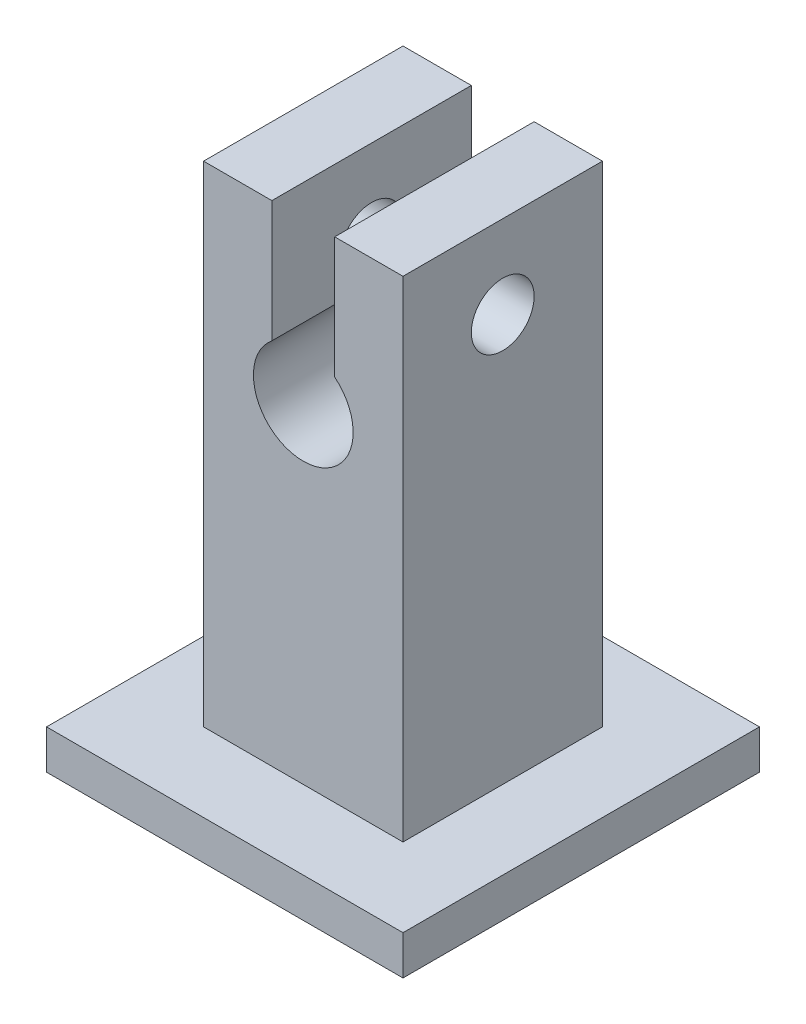
ISO-10303-21;
HEADER;
FILE_DESCRIPTION(('STEP AP214'),'2;1');
FILE_NAME('part.step','',(''),(''),'','','');
FILE_SCHEMA(('AUTOMOTIVE_DESIGN { 1 0 10303 214 1 1 1 1 }'));
ENDSEC;
DATA;
#1=APPLICATION_CONTEXT('core data for automotive mechanical design processes');
#2=APPLICATION_PROTOCOL_DEFINITION('international standard','automotive_design',2000,#1);
#3=PRODUCT_CONTEXT('',#1,'mechanical');
#4=PRODUCT('Part','Part','',(#3));
#5=PRODUCT_RELATED_PRODUCT_CATEGORY('part','',(#4));
#6=PRODUCT_DEFINITION_FORMATION('','',#4);
#7=PRODUCT_DEFINITION_CONTEXT('part definition',#1,'design');
#8=PRODUCT_DEFINITION('design','',#6,#7);
#9=PRODUCT_DEFINITION_SHAPE('','',#8);
#10=(LENGTH_UNIT() NAMED_UNIT(*) SI_UNIT(.MILLI.,.METRE.));
#11=(NAMED_UNIT(*) PLANE_ANGLE_UNIT() SI_UNIT($,.RADIAN.));
#12=(NAMED_UNIT(*) SI_UNIT($,.STERADIAN.) SOLID_ANGLE_UNIT());
#13=UNCERTAINTY_MEASURE_WITH_UNIT(LENGTH_MEASURE(1.E-05),#10,'distance_accuracy_value','');
#14=(GEOMETRIC_REPRESENTATION_CONTEXT(3) GLOBAL_UNCERTAINTY_ASSIGNED_CONTEXT((#13)) GLOBAL_UNIT_ASSIGNED_CONTEXT((#10,
#11,#12)) REPRESENTATION_CONTEXT('',''));
#15=CARTESIAN_POINT('',(0.,0.,0.));
#16=DIRECTION('',(0.,0.,1.));
#17=DIRECTION('',(1.,0.,0.));
#18=AXIS2_PLACEMENT_3D('',#15,#16,#17);
#19=CARTESIAN_POINT('',(0.,0.,12.7));
#20=DIRECTION('',(-1.,0.,0.));
#21=DIRECTION('',(0.,0.,1.));
#22=AXIS2_PLACEMENT_3D('',#19,#20,#21);
#23=PLANE('',#22);
#24=CARTESIAN_POINT('',(0.,25.920446166708,6.35));
#25=DIRECTION('',(1.,0.,0.));
#26=DIRECTION('',(0.,0.,-1.));
#27=AXIS2_PLACEMENT_3D('',#24,#25,#26);
#28=CIRCLE('',#27,2.);
#29=CARTESIAN_POINT('',(0.,25.920446166708,4.35));
#30=VERTEX_POINT('',#29);
#31=EDGE_CURVE('E218',#30,#30,#28,.T.);
#32=ORIENTED_EDGE('',*,*,#31,.F.);
#33=EDGE_LOOP('',(#32));
#34=FACE_BOUND('',#33,.T.);
#35=DIRECTION('',(0.,1.,0.));
#36=VECTOR('',#35,1.);
#37=CARTESIAN_POINT('',(0.,0.,0.));
#38=LINE('',#37,#36);
#39=CARTESIAN_POINT('',(0.,0.,0.));
#40=VERTEX_POINT('',#39);
#41=CARTESIAN_POINT('',(0.,31.2,0.));
#42=VERTEX_POINT('',#41);
#43=EDGE_CURVE('E130',#40,#42,#38,.T.);
#44=ORIENTED_EDGE('',*,*,#43,.T.);
#45=DIRECTION('',(0.,0.,-1.));
#46=VECTOR('',#45,1.);
#47=CARTESIAN_POINT('',(0.,31.2,12.7));
#48=LINE('',#47,#46);
#49=CARTESIAN_POINT('',(0.,31.2,12.7));
#50=VERTEX_POINT('',#49);
#51=EDGE_CURVE('E39',#50,#42,#48,.T.);
#52=ORIENTED_EDGE('',*,*,#51,.F.);
#53=DIRECTION('',(0.,1.,0.));
#54=VECTOR('',#53,1.);
#55=CARTESIAN_POINT('',(0.,0.,12.7));
#56=LINE('',#55,#54);
#57=CARTESIAN_POINT('',(0.,0.,12.7));
#58=VERTEX_POINT('',#57);
#59=EDGE_CURVE('E88',#58,#50,#56,.T.);
#60=ORIENTED_EDGE('',*,*,#59,.F.);
#61=DIRECTION('',(0.,0.,-1.));
#62=VECTOR('',#61,1.);
#63=CARTESIAN_POINT('',(0.,0.,12.7));
#64=LINE('',#63,#62);
#65=EDGE_CURVE('E11',#58,#40,#64,.T.);
#66=ORIENTED_EDGE('',*,*,#65,.T.);
#67=EDGE_LOOP('',(#44,#52,#60,#66));
#68=FACE_BOUND('',#67,.T.);
#69=ADVANCED_FACE('F30',(#34,#68),#23,.F.);
#70=CARTESIAN_POINT('',(0.,31.2,12.7));
#71=DIRECTION('',(0.,-1.,0.));
#72=DIRECTION('',(1.,0.,0.));
#73=AXIS2_PLACEMENT_3D('',#70,#71,#72);
#74=PLANE('',#73);
#75=DIRECTION('',(-1.,0.,0.));
#76=VECTOR('',#75,1.);
#77=CARTESIAN_POINT('',(0.,31.2,0.));
#78=LINE('',#77,#76);
#79=CARTESIAN_POINT('',(-4.35,31.2,0.));
#80=VERTEX_POINT('',#79);
#81=EDGE_CURVE('E133',#42,#80,#78,.T.);
#82=ORIENTED_EDGE('',*,*,#81,.T.);
#83=DIRECTION('',(0.,0.,-1.));
#84=VECTOR('',#83,1.);
#85=CARTESIAN_POINT('',(-4.35,31.2,12.7));
#86=LINE('',#85,#84);
#87=CARTESIAN_POINT('',(-4.35,31.2,12.7));
#88=VERTEX_POINT('',#87);
#89=EDGE_CURVE('E150',#88,#80,#86,.T.);
#90=ORIENTED_EDGE('',*,*,#89,.F.);
#91=DIRECTION('',(-1.,0.,0.));
#92=VECTOR('',#91,1.);
#93=CARTESIAN_POINT('',(0.,31.2,12.7));
#94=LINE('',#93,#92);
#95=EDGE_CURVE('E159',#50,#88,#94,.T.);
#96=ORIENTED_EDGE('',*,*,#95,.F.);
#97=ORIENTED_EDGE('',*,*,#51,.T.);
#98=EDGE_LOOP('',(#82,#90,#96,#97));
#99=FACE_BOUND('',#98,.T.);
#100=ADVANCED_FACE('F157',(#99),#74,.F.);
#101=CARTESIAN_POINT('',(-4.35,31.2,12.7));
#102=DIRECTION('',(1.,0.,0.));
#103=DIRECTION('',(0.,0.,-1.));
#104=AXIS2_PLACEMENT_3D('',#101,#102,#103);
#105=PLANE('',#104);
#106=CARTESIAN_POINT('',(-4.35,25.920446166708,6.35));
#107=DIRECTION('',(1.,0.,0.));
#108=DIRECTION('',(0.,0.,-1.));
#109=AXIS2_PLACEMENT_3D('',#106,#107,#108);
#110=CIRCLE('',#109,2.);
#111=CARTESIAN_POINT('',(-4.35,25.920446166708,4.35));
#112=VERTEX_POINT('',#111);
#113=EDGE_CURVE('E202',#112,#112,#110,.T.);
#114=ORIENTED_EDGE('',*,*,#113,.T.);
#115=EDGE_LOOP('',(#114));
#116=FACE_BOUND('',#115,.T.);
#117=DIRECTION('',(0.,-1.,0.));
#118=VECTOR('',#117,1.);
#119=CARTESIAN_POINT('',(-4.35,31.2,0.));
#120=LINE('',#119,#118);
#121=CARTESIAN_POINT('',(-4.35,23.465892333416,0.));
#122=VERTEX_POINT('',#121);
#123=EDGE_CURVE('E135',#80,#122,#120,.T.);
#124=ORIENTED_EDGE('',*,*,#123,.T.);
#125=DIRECTION('',(0.,0.,-1.));
#126=VECTOR('',#125,1.);
#127=CARTESIAN_POINT('',(-4.35,23.465892333416,12.7));
#128=LINE('',#127,#126);
#129=CARTESIAN_POINT('',(-4.35,23.465892333416,12.7));
#130=VERTEX_POINT('',#129);
#131=EDGE_CURVE('E147',#130,#122,#128,.T.);
#132=ORIENTED_EDGE('',*,*,#131,.F.);
#133=DIRECTION('',(0.,-1.,0.));
#134=VECTOR('',#133,1.);
#135=CARTESIAN_POINT('',(-4.35,31.2,12.7));
#136=LINE('',#135,#134);
#137=EDGE_CURVE('E171',#88,#130,#136,.T.);
#138=ORIENTED_EDGE('',*,*,#137,.F.);
#139=ORIENTED_EDGE('',*,*,#89,.T.);
#140=EDGE_LOOP('',(#124,#132,#138,#139));
#141=FACE_BOUND('',#140,.T.);
#142=ADVANCED_FACE('F167',(#116,#141),#105,.F.);
#143=CARTESIAN_POINT('',(-6.35,21.,12.7));
#144=DIRECTION('',(0.,0.,-1.));
#145=DIRECTION('',(-1.,0.,0.));
#146=AXIS2_PLACEMENT_3D('',#143,#144,#145);
#147=CYLINDRICAL_SURFACE('',#146,3.175);
#148=CARTESIAN_POINT('',(-6.35,21.,0.));
#149=DIRECTION('',(0.,0.,-1.));
#150=DIRECTION('',(-1.,0.,0.));
#151=AXIS2_PLACEMENT_3D('',#148,#149,#150);
#152=CIRCLE('',#151,3.175);
#153=CARTESIAN_POINT('',(-8.35,23.465892333416,0.));
#154=VERTEX_POINT('',#153);
#155=EDGE_CURVE('E137',#122,#154,#152,.T.);
#156=ORIENTED_EDGE('',*,*,#155,.T.);
#157=DIRECTION('',(0.,0.,-1.));
#158=VECTOR('',#157,1.);
#159=CARTESIAN_POINT('',(-8.35,23.465892333416,12.7));
#160=LINE('',#159,#158);
#161=CARTESIAN_POINT('',(-8.35,23.465892333416,12.7));
#162=VERTEX_POINT('',#161);
#163=EDGE_CURVE('E118',#162,#154,#160,.T.);
#164=ORIENTED_EDGE('',*,*,#163,.F.);
#165=CARTESIAN_POINT('',(-6.35,21.,12.7));
#166=DIRECTION('',(0.,0.,-1.));
#167=DIRECTION('',(-1.,0.,0.));
#168=AXIS2_PLACEMENT_3D('',#165,#166,#167);
#169=CIRCLE('',#168,3.175);
#170=EDGE_CURVE('E109',#130,#162,#169,.T.);
#171=ORIENTED_EDGE('',*,*,#170,.F.);
#172=ORIENTED_EDGE('',*,*,#131,.T.);
#173=EDGE_LOOP('',(#156,#164,#171,#172));
#174=FACE_BOUND('',#173,.T.);
#175=ADVANCED_FACE('F170',(#174),#147,.F.);
#176=CARTESIAN_POINT('',(-8.35,23.465892333416,12.7));
#177=DIRECTION('',(-1.,0.,0.));
#178=DIRECTION('',(0.,0.,1.));
#179=AXIS2_PLACEMENT_3D('',#176,#177,#178);
#180=PLANE('',#179);
#181=CARTESIAN_POINT('',(-8.35,25.920446166708,6.35));
#182=DIRECTION('',(-1.,0.,0.));
#183=DIRECTION('',(0.,0.,1.));
#184=AXIS2_PLACEMENT_3D('',#181,#182,#183);
#185=CIRCLE('',#184,2.);
#186=CARTESIAN_POINT('',(-8.35,25.920446166708,8.35));
#187=VERTEX_POINT('',#186);
#188=EDGE_CURVE('E215',#187,#187,#185,.T.);
#189=ORIENTED_EDGE('',*,*,#188,.T.);
#190=EDGE_LOOP('',(#189));
#191=FACE_BOUND('',#190,.T.);
#192=DIRECTION('',(0.,1.,0.));
#193=VECTOR('',#192,1.);
#194=CARTESIAN_POINT('',(-8.35,23.465892333416,0.));
#195=LINE('',#194,#193);
#196=CARTESIAN_POINT('',(-8.35,31.2,0.));
#197=VERTEX_POINT('',#196);
#198=EDGE_CURVE('E117',#154,#197,#195,.T.);
#199=ORIENTED_EDGE('',*,*,#198,.T.);
#200=DIRECTION('',(0.,0.,-1.));
#201=VECTOR('',#200,1.);
#202=CARTESIAN_POINT('',(-8.35,31.2,12.7));
#203=LINE('',#202,#201);
#204=CARTESIAN_POINT('',(-8.35,31.2,12.7));
#205=VERTEX_POINT('',#204);
#206=EDGE_CURVE('E114',#205,#197,#203,.T.);
#207=ORIENTED_EDGE('',*,*,#206,.F.);
#208=DIRECTION('',(0.,1.,0.));
#209=VECTOR('',#208,1.);
#210=CARTESIAN_POINT('',(-8.35,23.465892333416,12.7));
#211=LINE('',#210,#209);
#212=EDGE_CURVE('E103',#162,#205,#211,.T.);
#213=ORIENTED_EDGE('',*,*,#212,.F.);
#214=ORIENTED_EDGE('',*,*,#163,.T.);
#215=EDGE_LOOP('',(#199,#207,#213,#214));
#216=FACE_BOUND('',#215,.T.);
#217=ADVANCED_FACE('F115',(#191,#216),#180,.F.);
#218=CARTESIAN_POINT('',(-8.35,31.2,12.7));
#219=DIRECTION('',(0.,-1.,0.));
#220=DIRECTION('',(0.,0.,-1.));
#221=AXIS2_PLACEMENT_3D('',#218,#219,#220);
#222=PLANE('',#221);
#223=DIRECTION('',(-1.,0.,0.));
#224=VECTOR('',#223,1.);
#225=CARTESIAN_POINT('',(-8.35,31.2,0.));
#226=LINE('',#225,#224);
#227=CARTESIAN_POINT('',(-12.7,31.2,0.));
#228=VERTEX_POINT('',#227);
#229=EDGE_CURVE('E74',#197,#228,#226,.T.);
#230=ORIENTED_EDGE('',*,*,#229,.T.);
#231=DIRECTION('',(0.,0.,-1.));
#232=VECTOR('',#231,1.);
#233=CARTESIAN_POINT('',(-12.7,31.2,12.7));
#234=LINE('',#233,#232);
#235=CARTESIAN_POINT('',(-12.7,31.2,12.7));
#236=VERTEX_POINT('',#235);
#237=EDGE_CURVE('E119',#236,#228,#234,.T.);
#238=ORIENTED_EDGE('',*,*,#237,.F.);
#239=DIRECTION('',(-1.,0.,0.));
#240=VECTOR('',#239,1.);
#241=CARTESIAN_POINT('',(-8.35,31.2,12.7));
#242=LINE('',#241,#240);
#243=EDGE_CURVE('E107',#205,#236,#242,.T.);
#244=ORIENTED_EDGE('',*,*,#243,.F.);
#245=ORIENTED_EDGE('',*,*,#206,.T.);
#246=EDGE_LOOP('',(#230,#238,#244,#245));
#247=FACE_BOUND('',#246,.T.);
#248=ADVANCED_FACE('F121',(#247),#222,.F.);
#249=CARTESIAN_POINT('',(-12.7,31.2,12.7));
#250=DIRECTION('',(1.,0.,0.));
#251=DIRECTION('',(0.,0.,-1.));
#252=AXIS2_PLACEMENT_3D('',#249,#250,#251);
#253=PLANE('',#252);
#254=CARTESIAN_POINT('',(-12.7,25.920446166708,6.35));
#255=DIRECTION('',(1.,0.,0.));
#256=DIRECTION('',(0.,0.,-1.));
#257=AXIS2_PLACEMENT_3D('',#254,#255,#256);
#258=CIRCLE('',#257,2.);
#259=CARTESIAN_POINT('',(-12.7,25.920446166708,4.35));
#260=VERTEX_POINT('',#259);
#261=EDGE_CURVE('E33',#260,#260,#258,.T.);
#262=ORIENTED_EDGE('',*,*,#261,.T.);
#263=EDGE_LOOP('',(#262));
#264=FACE_BOUND('',#263,.T.);
#265=DIRECTION('',(0.,-1.,0.));
#266=VECTOR('',#265,1.);
#267=CARTESIAN_POINT('',(-12.7,31.2,0.));
#268=LINE('',#267,#266);
#269=CARTESIAN_POINT('',(-12.7,0.,0.));
#270=VERTEX_POINT('',#269);
#271=EDGE_CURVE('E80',#228,#270,#268,.T.);
#272=ORIENTED_EDGE('',*,*,#271,.T.);
#273=DIRECTION('',(0.,0.,-1.));
#274=VECTOR('',#273,1.);
#275=CARTESIAN_POINT('',(-12.7,0.,12.7));
#276=LINE('',#275,#274);
#277=CARTESIAN_POINT('',(-12.7,0.,12.7));
#278=VERTEX_POINT('',#277);
#279=EDGE_CURVE('E123',#278,#270,#276,.T.);
#280=ORIENTED_EDGE('',*,*,#279,.F.);
#281=DIRECTION('',(0.,-1.,0.));
#282=VECTOR('',#281,1.);
#283=CARTESIAN_POINT('',(-12.7,31.2,12.7));
#284=LINE('',#283,#282);
#285=EDGE_CURVE('E47',#236,#278,#284,.T.);
#286=ORIENTED_EDGE('',*,*,#285,.F.);
#287=ORIENTED_EDGE('',*,*,#237,.T.);
#288=EDGE_LOOP('',(#272,#280,#286,#287));
#289=FACE_BOUND('',#288,.T.);
#290=ADVANCED_FACE('F225',(#264,#289),#253,.F.);
#291=CARTESIAN_POINT('',(-6.35,21.,12.7));
#292=DIRECTION('',(0.,0.,-1.));
#293=DIRECTION('',(-1.,0.,0.));
#294=AXIS2_PLACEMENT_3D('',#291,#292,#293);
#295=PLANE('',#294);
#296=DIRECTION('',(1.,0.,0.));
#297=VECTOR('',#296,1.);
#298=CARTESIAN_POINT('',(-12.7,0.,12.7));
#299=LINE('',#298,#297);
#300=EDGE_CURVE('E142',#278,#58,#299,.T.);
#301=ORIENTED_EDGE('',*,*,#300,.T.);
#302=ORIENTED_EDGE('',*,*,#59,.T.);
#303=ORIENTED_EDGE('',*,*,#95,.T.);
#304=ORIENTED_EDGE('',*,*,#137,.T.);
#305=ORIENTED_EDGE('',*,*,#170,.T.);
#306=ORIENTED_EDGE('',*,*,#212,.T.);
#307=ORIENTED_EDGE('',*,*,#243,.T.);
#308=ORIENTED_EDGE('',*,*,#285,.T.);
#309=EDGE_LOOP('',(#301,#302,#303,#304,#305,#306,#307,#308));
#310=FACE_BOUND('',#309,.T.);
#311=ADVANCED_FACE('F105',(#310),#295,.F.);
#312=CARTESIAN_POINT('',(-6.35,21.,0.));
#313=DIRECTION('',(0.,0.,-1.));
#314=DIRECTION('',(-1.,0.,0.));
#315=AXIS2_PLACEMENT_3D('',#312,#313,#314);
#316=PLANE('',#315);
#317=DIRECTION('',(1.,0.,0.));
#318=VECTOR('',#317,1.);
#319=CARTESIAN_POINT('',(-12.7,0.,0.));
#320=LINE('',#319,#318);
#321=EDGE_CURVE('E127',#270,#40,#320,.T.);
#322=ORIENTED_EDGE('',*,*,#321,.F.);
#323=ORIENTED_EDGE('',*,*,#271,.F.);
#324=ORIENTED_EDGE('',*,*,#229,.F.);
#325=ORIENTED_EDGE('',*,*,#198,.F.);
#326=ORIENTED_EDGE('',*,*,#155,.F.);
#327=ORIENTED_EDGE('',*,*,#123,.F.);
#328=ORIENTED_EDGE('',*,*,#81,.F.);
#329=ORIENTED_EDGE('',*,*,#43,.F.);
#330=EDGE_LOOP('',(#322,#323,#324,#325,#326,#327,#328,#329));
#331=FACE_BOUND('',#330,.T.);
#332=ADVANCED_FACE('F163',(#331),#316,.T.);
#333=CARTESIAN_POINT('',(-17.7,0.,-4.99999999999999));
#334=DIRECTION('',(0.,-1.,0.));
#335=DIRECTION('',(0.,0.,-1.));
#336=AXIS2_PLACEMENT_3D('',#333,#334,#335);
#337=PLANE('',#336);
#338=DIRECTION('',(0.,0.,-1.));
#339=VECTOR('',#338,1.);
#340=CARTESIAN_POINT('',(-17.7,0.,17.7));
#341=LINE('',#340,#339);
#342=CARTESIAN_POINT('',(-17.7,0.,17.7));
#343=VERTEX_POINT('',#342);
#344=CARTESIAN_POINT('',(-17.7,0.,-4.99999999999999));
#345=VERTEX_POINT('',#344);
#346=EDGE_CURVE('E199',#343,#345,#341,.T.);
#347=ORIENTED_EDGE('',*,*,#346,.F.);
#348=DIRECTION('',(-1.,0.,0.));
#349=VECTOR('',#348,1.);
#350=CARTESIAN_POINT('',(-17.7,0.,17.7));
#351=LINE('',#350,#349);
#352=CARTESIAN_POINT('',(5.,0.,17.7));
#353=VERTEX_POINT('',#352);
#354=EDGE_CURVE('E189',#353,#343,#351,.T.);
#355=ORIENTED_EDGE('',*,*,#354,.F.);
#356=DIRECTION('',(0.,0.,1.));
#357=VECTOR('',#356,1.);
#358=CARTESIAN_POINT('',(5.,0.,17.7));
#359=LINE('',#358,#357);
#360=CARTESIAN_POINT('',(5.,0.,-4.99999999999999));
#361=VERTEX_POINT('',#360);
#362=EDGE_CURVE('E193',#361,#353,#359,.T.);
#363=ORIENTED_EDGE('',*,*,#362,.F.);
#364=DIRECTION('',(1.,0.,0.));
#365=VECTOR('',#364,1.);
#366=CARTESIAN_POINT('',(-17.7,0.,-4.99999999999999));
#367=LINE('',#366,#365);
#368=EDGE_CURVE('E196',#345,#361,#367,.T.);
#369=ORIENTED_EDGE('',*,*,#368,.F.);
#370=EDGE_LOOP('',(#347,#355,#363,#369));
#371=FACE_BOUND('',#370,.T.);
#372=ORIENTED_EDGE('',*,*,#65,.F.);
#373=ORIENTED_EDGE('',*,*,#300,.F.);
#374=ORIENTED_EDGE('',*,*,#279,.T.);
#375=ORIENTED_EDGE('',*,*,#321,.T.);
#376=EDGE_LOOP('',(#372,#373,#374,#375));
#377=FACE_BOUND('',#376,.T.);
#378=ADVANCED_FACE('F252',(#371,#377),#337,.F.);
#379=CARTESIAN_POINT('',(-17.7,-2.5,17.7));
#380=DIRECTION('',(1.,0.,0.));
#381=DIRECTION('',(0.,0.,-1.));
#382=AXIS2_PLACEMENT_3D('',#379,#380,#381);
#383=PLANE('',#382);
#384=ORIENTED_EDGE('',*,*,#346,.T.);
#385=DIRECTION('',(0.,1.,0.));
#386=VECTOR('',#385,1.);
#387=CARTESIAN_POINT('',(-17.7,-2.5,-4.99999999999999));
#388=LINE('',#387,#386);
#389=CARTESIAN_POINT('',(-17.7,-2.5,-4.99999999999999));
#390=VERTEX_POINT('',#389);
#391=EDGE_CURVE('E131',#390,#345,#388,.T.);
#392=ORIENTED_EDGE('',*,*,#391,.F.);
#393=DIRECTION('',(0.,0.,-1.));
#394=VECTOR('',#393,1.);
#395=CARTESIAN_POINT('',(-17.7,-2.5,17.7));
#396=LINE('',#395,#394);
#397=CARTESIAN_POINT('',(-17.7,-2.5,17.7));
#398=VERTEX_POINT('',#397);
#399=EDGE_CURVE('E192',#398,#390,#396,.T.);
#400=ORIENTED_EDGE('',*,*,#399,.F.);
#401=DIRECTION('',(0.,1.,0.));
#402=VECTOR('',#401,1.);
#403=CARTESIAN_POINT('',(-17.7,-2.5,17.7));
#404=LINE('',#403,#402);
#405=EDGE_CURVE('E185',#398,#343,#404,.T.);
#406=ORIENTED_EDGE('',*,*,#405,.T.);
#407=EDGE_LOOP('',(#384,#392,#400,#406));
#408=FACE_BOUND('',#407,.T.);
#409=ADVANCED_FACE('F262',(#408),#383,.F.);
#410=CARTESIAN_POINT('',(-17.7,-2.5,-4.99999999999999));
#411=DIRECTION('',(0.,0.,1.));
#412=DIRECTION('',(1.,0.,0.));
#413=AXIS2_PLACEMENT_3D('',#410,#411,#412);
#414=PLANE('',#413);
#415=ORIENTED_EDGE('',*,*,#368,.T.);
#416=DIRECTION('',(0.,1.,0.));
#417=VECTOR('',#416,1.);
#418=CARTESIAN_POINT('',(5.,-2.5,-4.99999999999999));
#419=LINE('',#418,#417);
#420=CARTESIAN_POINT('',(5.,-2.5,-4.99999999999999));
#421=VERTEX_POINT('',#420);
#422=EDGE_CURVE('E179',#421,#361,#419,.T.);
#423=ORIENTED_EDGE('',*,*,#422,.F.);
#424=DIRECTION('',(1.,0.,0.));
#425=VECTOR('',#424,1.);
#426=CARTESIAN_POINT('',(-17.7,-2.5,-4.99999999999999));
#427=LINE('',#426,#425);
#428=EDGE_CURVE('E208',#390,#421,#427,.T.);
#429=ORIENTED_EDGE('',*,*,#428,.F.);
#430=ORIENTED_EDGE('',*,*,#391,.T.);
#431=EDGE_LOOP('',(#415,#423,#429,#430));
#432=FACE_BOUND('',#431,.T.);
#433=ADVANCED_FACE('F265',(#432),#414,.F.);
#434=CARTESIAN_POINT('',(5.,-2.5,17.7));
#435=DIRECTION('',(-1.,0.,0.));
#436=DIRECTION('',(0.,0.,1.));
#437=AXIS2_PLACEMENT_3D('',#434,#435,#436);
#438=PLANE('',#437);
#439=ORIENTED_EDGE('',*,*,#362,.T.);
#440=DIRECTION('',(0.,1.,0.));
#441=VECTOR('',#440,1.);
#442=CARTESIAN_POINT('',(5.,-2.5,17.7));
#443=LINE('',#442,#441);
#444=CARTESIAN_POINT('',(5.,-2.5,17.7));
#445=VERTEX_POINT('',#444);
#446=EDGE_CURVE('E182',#445,#353,#443,.T.);
#447=ORIENTED_EDGE('',*,*,#446,.F.);
#448=DIRECTION('',(0.,0.,1.));
#449=VECTOR('',#448,1.);
#450=CARTESIAN_POINT('',(5.,-2.5,17.7));
#451=LINE('',#450,#449);
#452=EDGE_CURVE('E205',#421,#445,#451,.T.);
#453=ORIENTED_EDGE('',*,*,#452,.F.);
#454=ORIENTED_EDGE('',*,*,#422,.T.);
#455=EDGE_LOOP('',(#439,#447,#453,#454));
#456=FACE_BOUND('',#455,.T.);
#457=ADVANCED_FACE('F269',(#456),#438,.F.);
#458=CARTESIAN_POINT('',(-17.7,-2.5,17.7));
#459=DIRECTION('',(0.,0.,-1.));
#460=DIRECTION('',(-1.,0.,0.));
#461=AXIS2_PLACEMENT_3D('',#458,#459,#460);
#462=PLANE('',#461);
#463=ORIENTED_EDGE('',*,*,#354,.T.);
#464=ORIENTED_EDGE('',*,*,#405,.F.);
#465=DIRECTION('',(-1.,0.,0.));
#466=VECTOR('',#465,1.);
#467=CARTESIAN_POINT('',(-17.7,-2.5,17.7));
#468=LINE('',#467,#466);
#469=EDGE_CURVE('E188',#445,#398,#468,.T.);
#470=ORIENTED_EDGE('',*,*,#469,.F.);
#471=ORIENTED_EDGE('',*,*,#446,.T.);
#472=EDGE_LOOP('',(#463,#464,#470,#471));
#473=FACE_BOUND('',#472,.T.);
#474=ADVANCED_FACE('F273',(#473),#462,.F.);
#475=CARTESIAN_POINT('',(-17.7,-2.5,-4.99999999999999));
#476=DIRECTION('',(0.,-1.,0.));
#477=DIRECTION('',(0.,0.,-1.));
#478=AXIS2_PLACEMENT_3D('',#475,#476,#477);
#479=PLANE('',#478);
#480=ORIENTED_EDGE('',*,*,#399,.T.);
#481=ORIENTED_EDGE('',*,*,#428,.T.);
#482=ORIENTED_EDGE('',*,*,#452,.T.);
#483=ORIENTED_EDGE('',*,*,#469,.T.);
#484=EDGE_LOOP('',(#480,#481,#482,#483));
#485=FACE_BOUND('',#484,.T.);
#486=ADVANCED_FACE('F231',(#485),#479,.T.);
#487=CARTESIAN_POINT('',(-17.7,25.920446166708,6.35));
#488=DIRECTION('',(1.,0.,0.));
#489=DIRECTION('',(0.,0.,-1.));
#490=AXIS2_PLACEMENT_3D('',#487,#488,#489);
#491=CYLINDRICAL_SURFACE('',#490,2.);
#492=ORIENTED_EDGE('',*,*,#261,.F.);
#493=EDGE_LOOP('',(#492));
#494=FACE_BOUND('',#493,.T.);
#495=ORIENTED_EDGE('',*,*,#188,.F.);
#496=EDGE_LOOP('',(#495));
#497=FACE_BOUND('',#496,.T.);
#498=ADVANCED_FACE('F227',(#494,#497),#491,.F.);
#499=ORIENTED_EDGE('',*,*,#31,.T.);
#500=EDGE_LOOP('',(#499));
#501=FACE_BOUND('',#500,.T.);
#502=ORIENTED_EDGE('',*,*,#113,.F.);
#503=EDGE_LOOP('',(#502));
#504=FACE_BOUND('',#503,.T.);
#505=ADVANCED_FACE('F230',(#501,#504),#491,.F.);
#506=CLOSED_SHELL('',(#69,#100,#142,#175,#217,#248,#290,#311,#332,#378,#409,#433,#457,#474,#486,
#498,#505));
#507=MANIFOLD_SOLID_BREP('B2',#506);
#508=ADVANCED_BREP_SHAPE_REPRESENTATION('',(#18,#507),#14);
#509=SHAPE_DEFINITION_REPRESENTATION(#9,#508);
ENDSEC;
END-ISO-10303-21;
